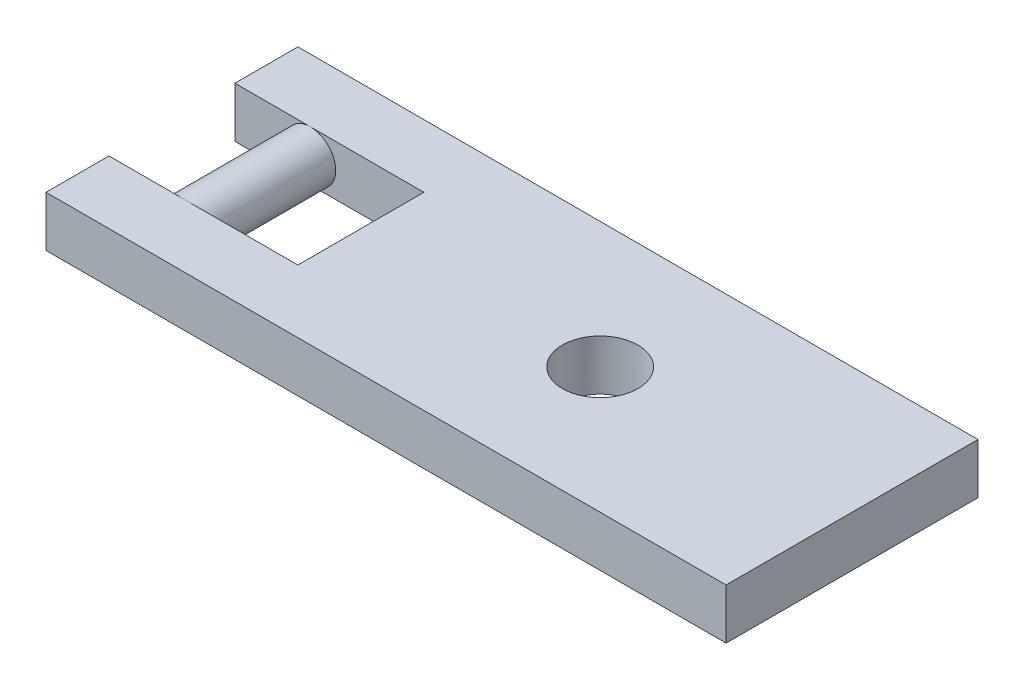
ISO-10303-21;
HEADER;
FILE_DESCRIPTION(('STEP AP214'),'2;1');
FILE_NAME('part.step','',(''),(''),'','','');
FILE_SCHEMA(('AUTOMOTIVE_DESIGN { 1 0 10303 214 1 1 1 1 }'));
ENDSEC;
DATA;
#1=APPLICATION_CONTEXT('core data for automotive mechanical design processes');
#2=APPLICATION_PROTOCOL_DEFINITION('international standard','automotive_design',2000,#1);
#3=PRODUCT_CONTEXT('',#1,'mechanical');
#4=PRODUCT('Part','Part','',(#3));
#5=PRODUCT_RELATED_PRODUCT_CATEGORY('part','',(#4));
#6=PRODUCT_DEFINITION_FORMATION('','',#4);
#7=PRODUCT_DEFINITION_CONTEXT('part definition',#1,'design');
#8=PRODUCT_DEFINITION('design','',#6,#7);
#9=PRODUCT_DEFINITION_SHAPE('','',#8);
#10=(LENGTH_UNIT() NAMED_UNIT(*) SI_UNIT(.MILLI.,.METRE.));
#11=(NAMED_UNIT(*) PLANE_ANGLE_UNIT() SI_UNIT($,.RADIAN.));
#12=(NAMED_UNIT(*) SI_UNIT($,.STERADIAN.) SOLID_ANGLE_UNIT());
#13=UNCERTAINTY_MEASURE_WITH_UNIT(LENGTH_MEASURE(1.E-05),#10,'distance_accuracy_value','');
#14=(GEOMETRIC_REPRESENTATION_CONTEXT(3) GLOBAL_UNCERTAINTY_ASSIGNED_CONTEXT((#13)) GLOBAL_UNIT_ASSIGNED_CONTEXT((#10,
#11,#12)) REPRESENTATION_CONTEXT('',''));
#15=CARTESIAN_POINT('',(0.,0.,0.));
#16=DIRECTION('',(0.,0.,1.));
#17=DIRECTION('',(1.,0.,0.));
#18=AXIS2_PLACEMENT_3D('',#15,#16,#17);
#19=CARTESIAN_POINT('',(-24.2987972115879,30.4038054968287,-2.5));
#20=DIRECTION('',(0.,0.,-1.));
#21=DIRECTION('',(-1.,0.,0.));
#22=AXIS2_PLACEMENT_3D('',#19,#20,#21);
#23=PLANE('',#22);
#24=CARTESIAN_POINT('',(-28.7987972115879,39.4038054968287,-2.5));
#25=DIRECTION('',(0.,0.,1.));
#26=DIRECTION('',(1.,0.,0.));
#27=AXIS2_PLACEMENT_3D('',#24,#25,#26);
#28=CIRCLE('',#27,1.);
#29=CARTESIAN_POINT('',(-28.7987972115879,38.4038054968287,-2.5));
#30=VERTEX_POINT('',#29);
#31=CARTESIAN_POINT('',(-28.7987972115879,40.4038054968287,-2.5));
#32=VERTEX_POINT('',#31);
#33=EDGE_CURVE('E144',#30,#32,#28,.T.);
#34=ORIENTED_EDGE('',*,*,#33,.F.);
#35=DIRECTION('',(1.,0.,0.));
#36=VECTOR('',#35,1.);
#37=CARTESIAN_POINT('',(-29.7987972115879,38.4038054968288,-2.5));
#38=LINE('',#37,#36);
#39=CARTESIAN_POINT('',(-24.2987972115879,38.4038054968288,-2.5));
#40=VERTEX_POINT('',#39);
#41=EDGE_CURVE('E197',#30,#40,#38,.T.);
#42=ORIENTED_EDGE('',*,*,#41,.T.);
#43=DIRECTION('',(0.,1.,0.));
#44=VECTOR('',#43,1.);
#45=CARTESIAN_POINT('',(-24.2987972115879,30.4038054968287,-2.5));
#46=LINE('',#45,#44);
#47=CARTESIAN_POINT('',(-24.2987972115879,40.4038054968287,-2.5));
#48=VERTEX_POINT('',#47);
#49=EDGE_CURVE('E156',#40,#48,#46,.T.);
#50=ORIENTED_EDGE('',*,*,#49,.T.);
#51=DIRECTION('',(-1.,0.,0.));
#52=VECTOR('',#51,1.);
#53=CARTESIAN_POINT('',(-24.2987972115879,40.4038054968287,-2.5));
#54=LINE('',#53,#52);
#55=EDGE_CURVE('E153',#48,#32,#54,.T.);
#56=ORIENTED_EDGE('',*,*,#55,.T.);
#57=EDGE_LOOP('',(#34,#42,#50,#56));
#58=FACE_BOUND('',#57,.T.);
#59=ADVANCED_FACE('F33',(#58),#23,.F.);
#60=CARTESIAN_POINT('',(-24.2987972115879,30.4038054968287,2.5));
#61=DIRECTION('',(0.,0.,1.));
#62=DIRECTION('',(1.,0.,0.));
#63=AXIS2_PLACEMENT_3D('',#60,#61,#62);
#64=PLANE('',#63);
#65=CARTESIAN_POINT('',(-28.7987972115879,39.4038054968287,2.5));
#66=DIRECTION('',(0.,0.,1.));
#67=DIRECTION('',(1.,0.,0.));
#68=AXIS2_PLACEMENT_3D('',#65,#66,#67);
#69=CIRCLE('',#68,1.);
#70=CARTESIAN_POINT('',(-28.7987972115879,40.4038054968287,2.5));
#71=VERTEX_POINT('',#70);
#72=CARTESIAN_POINT('',(-28.7987972115879,38.4038054968287,2.5));
#73=VERTEX_POINT('',#72);
#74=EDGE_CURVE('E129',#71,#73,#69,.T.);
#75=ORIENTED_EDGE('',*,*,#74,.T.);
#76=DIRECTION('',(-1.,0.,0.));
#77=VECTOR('',#76,1.);
#78=CARTESIAN_POINT('',(-29.7987972115879,38.4038054968288,2.5));
#79=LINE('',#78,#77);
#80=CARTESIAN_POINT('',(-31.7987972115879,38.4038054968288,2.5));
#81=VERTEX_POINT('',#80);
#82=EDGE_CURVE('E116',#73,#81,#79,.T.);
#83=ORIENTED_EDGE('',*,*,#82,.T.);
#84=DIRECTION('',(0.,-1.,0.));
#85=VECTOR('',#84,1.);
#86=CARTESIAN_POINT('',(-31.7987972115879,40.4038054968287,2.5));
#87=LINE('',#86,#85);
#88=CARTESIAN_POINT('',(-31.7987972115879,40.4038054968287,2.5));
#89=VERTEX_POINT('',#88);
#90=EDGE_CURVE('E158',#89,#81,#87,.T.);
#91=ORIENTED_EDGE('',*,*,#90,.F.);
#92=DIRECTION('',(1.,0.,0.));
#93=VECTOR('',#92,1.);
#94=CARTESIAN_POINT('',(-24.2987972115879,40.4038054968287,2.5));
#95=LINE('',#94,#93);
#96=EDGE_CURVE('E132',#89,#71,#95,.T.);
#97=ORIENTED_EDGE('',*,*,#96,.T.);
#98=EDGE_LOOP('',(#75,#83,#91,#97));
#99=FACE_BOUND('',#98,.T.);
#100=ADVANCED_FACE('F130',(#99),#64,.F.);
#101=CARTESIAN_POINT('',(-31.7987972115879,40.4038054968287,5.));
#102=DIRECTION('',(1.,0.,0.));
#103=DIRECTION('',(0.,0.,-1.));
#104=AXIS2_PLACEMENT_3D('',#101,#102,#103);
#105=PLANE('',#104);
#106=DIRECTION('',(0.,0.,-1.));
#107=VECTOR('',#106,1.);
#108=CARTESIAN_POINT('',(-31.7987972115879,38.4038054968288,5.));
#109=LINE('',#108,#107);
#110=CARTESIAN_POINT('',(-31.7987972115879,38.4038054968288,-2.5));
#111=VERTEX_POINT('',#110);
#112=CARTESIAN_POINT('',(-31.7987972115879,38.4038054968288,-5.));
#113=VERTEX_POINT('',#112);
#114=EDGE_CURVE('E193',#111,#113,#109,.T.);
#115=ORIENTED_EDGE('',*,*,#114,.F.);
#116=DIRECTION('',(0.,1.,0.));
#117=VECTOR('',#116,1.);
#118=CARTESIAN_POINT('',(-31.7987972115879,40.4038054968287,-2.5));
#119=LINE('',#118,#117);
#120=CARTESIAN_POINT('',(-31.7987972115879,40.4038054968287,-2.5));
#121=VERTEX_POINT('',#120);
#122=EDGE_CURVE('E161',#111,#121,#119,.T.);
#123=ORIENTED_EDGE('',*,*,#122,.T.);
#124=DIRECTION('',(0.,0.,-1.));
#125=VECTOR('',#124,1.);
#126=CARTESIAN_POINT('',(-31.7987972115879,40.4038054968287,5.));
#127=LINE('',#126,#125);
#128=CARTESIAN_POINT('',(-31.7987972115879,40.4038054968287,-5.));
#129=VERTEX_POINT('',#128);
#130=EDGE_CURVE('E191',#121,#129,#127,.T.);
#131=ORIENTED_EDGE('',*,*,#130,.T.);
#132=DIRECTION('',(0.,-1.,0.));
#133=VECTOR('',#132,1.);
#134=CARTESIAN_POINT('',(-31.7987972115879,40.4038054968287,-5.));
#135=LINE('',#134,#133);
#136=EDGE_CURVE('E182',#129,#113,#135,.T.);
#137=ORIENTED_EDGE('',*,*,#136,.T.);
#138=EDGE_LOOP('',(#115,#123,#131,#137));
#139=FACE_BOUND('',#138,.T.);
#140=ADVANCED_FACE('F210',(#139),#105,.F.);
#141=CARTESIAN_POINT('',(-4.79879721158793,40.4038054968287,5.));
#142=DIRECTION('',(1.,0.,0.));
#143=DIRECTION('',(0.,0.,-1.));
#144=AXIS2_PLACEMENT_3D('',#141,#142,#143);
#145=PLANE('',#144);
#146=DIRECTION('',(0.,-1.,0.));
#147=VECTOR('',#146,1.);
#148=CARTESIAN_POINT('',(-4.79879721158793,40.4038054968287,-5.));
#149=LINE('',#148,#147);
#150=CARTESIAN_POINT('',(-4.79879721158793,40.4038054968287,-5.));
#151=VERTEX_POINT('',#150);
#152=CARTESIAN_POINT('',(-4.79879721158793,38.4038054968287,-5.));
#153=VERTEX_POINT('',#152);
#154=EDGE_CURVE('E164',#151,#153,#149,.T.);
#155=ORIENTED_EDGE('',*,*,#154,.F.);
#156=DIRECTION('',(0.,0.,-1.));
#157=VECTOR('',#156,1.);
#158=CARTESIAN_POINT('',(-4.79879721158793,40.4038054968287,5.));
#159=LINE('',#158,#157);
#160=CARTESIAN_POINT('',(-4.79879721158793,40.4038054968287,5.));
#161=VERTEX_POINT('',#160);
#162=EDGE_CURVE('E126',#161,#151,#159,.T.);
#163=ORIENTED_EDGE('',*,*,#162,.F.);
#164=DIRECTION('',(0.,-1.,0.));
#165=VECTOR('',#164,1.);
#166=CARTESIAN_POINT('',(-4.79879721158793,40.4038054968287,5.));
#167=LINE('',#166,#165);
#168=CARTESIAN_POINT('',(-4.79879721158793,38.4038054968287,5.));
#169=VERTEX_POINT('',#168);
#170=EDGE_CURVE('E165',#161,#169,#167,.T.);
#171=ORIENTED_EDGE('',*,*,#170,.T.);
#172=DIRECTION('',(0.,0.,-1.));
#173=VECTOR('',#172,1.);
#174=CARTESIAN_POINT('',(-4.79879721158793,38.4038054968287,5.));
#175=LINE('',#174,#173);
#176=EDGE_CURVE('E176',#169,#153,#175,.T.);
#177=ORIENTED_EDGE('',*,*,#176,.T.);
#178=EDGE_LOOP('',(#155,#163,#171,#177));
#179=FACE_BOUND('',#178,.T.);
#180=ADVANCED_FACE('F35',(#179),#145,.T.);
#181=CARTESIAN_POINT('',(-4.79879721158793,40.4038054968287,5.));
#182=DIRECTION('',(0.,-1.,0.));
#183=DIRECTION('',(0.,0.,-1.));
#184=AXIS2_PLACEMENT_3D('',#181,#182,#183);
#185=PLANE('',#184);
#186=CARTESIAN_POINT('',(-14.7987972115879,40.4038054968287,0.));
#187=DIRECTION('',(0.,1.,0.));
#188=DIRECTION('',(0.,0.,1.));
#189=AXIS2_PLACEMENT_3D('',#186,#187,#188);
#190=CIRCLE('',#189,1.5);
#191=CARTESIAN_POINT('',(-14.7987972115879,40.4038054968287,1.5));
#192=VERTEX_POINT('',#191);
#193=EDGE_CURVE('E342',#192,#192,#190,.T.);
#194=ORIENTED_EDGE('',*,*,#193,.F.);
#195=EDGE_LOOP('',(#194));
#196=FACE_BOUND('',#195,.T.);
#197=ORIENTED_EDGE('',*,*,#130,.F.);
#198=EDGE_CURVE('E152',#32,#121,#54,.T.);
#199=ORIENTED_EDGE('',*,*,#198,.F.);
#200=ORIENTED_EDGE('',*,*,#55,.F.);
#201=DIRECTION('',(0.,0.,-1.));
#202=VECTOR('',#201,1.);
#203=CARTESIAN_POINT('',(-24.2987972115879,40.4038054968287,-2.5));
#204=LINE('',#203,#202);
#205=CARTESIAN_POINT('',(-24.2987972115879,40.4038054968287,2.5));
#206=VERTEX_POINT('',#205);
#207=EDGE_CURVE('E149',#206,#48,#204,.T.);
#208=ORIENTED_EDGE('',*,*,#207,.F.);
#209=EDGE_CURVE('E134',#71,#206,#95,.T.);
#210=ORIENTED_EDGE('',*,*,#209,.F.);
#211=ORIENTED_EDGE('',*,*,#96,.F.);
#212=CARTESIAN_POINT('',(-31.7987972115879,40.4038054968287,5.));
#213=VERTEX_POINT('',#212);
#214=EDGE_CURVE('E188',#213,#89,#127,.T.);
#215=ORIENTED_EDGE('',*,*,#214,.F.);
#216=DIRECTION('',(-1.,0.,0.));
#217=VECTOR('',#216,1.);
#218=CARTESIAN_POINT('',(-4.79879721158793,40.4038054968287,5.));
#219=LINE('',#218,#217);
#220=EDGE_CURVE('E174',#161,#213,#219,.T.);
#221=ORIENTED_EDGE('',*,*,#220,.F.);
#222=ORIENTED_EDGE('',*,*,#162,.T.);
#223=DIRECTION('',(-1.,0.,0.));
#224=VECTOR('',#223,1.);
#225=CARTESIAN_POINT('',(-4.79879721158793,40.4038054968287,-5.));
#226=LINE('',#225,#224);
#227=EDGE_CURVE('E169',#151,#129,#226,.T.);
#228=ORIENTED_EDGE('',*,*,#227,.T.);
#229=EDGE_LOOP('',(#197,#199,#200,#208,#210,#211,#215,#221,#222,#228));
#230=FACE_BOUND('',#229,.T.);
#231=ADVANCED_FACE('F206',(#196,#230),#185,.F.);
#232=ORIENTED_EDGE('',*,*,#214,.T.);
#233=ORIENTED_EDGE('',*,*,#90,.T.);
#234=CARTESIAN_POINT('',(-31.7987972115879,38.4038054968288,5.));
#235=VERTEX_POINT('',#234);
#236=EDGE_CURVE('E123',#235,#81,#109,.T.);
#237=ORIENTED_EDGE('',*,*,#236,.F.);
#238=DIRECTION('',(0.,-1.,0.));
#239=VECTOR('',#238,1.);
#240=CARTESIAN_POINT('',(-31.7987972115879,40.4038054968287,5.));
#241=LINE('',#240,#239);
#242=EDGE_CURVE('E171',#213,#235,#241,.T.);
#243=ORIENTED_EDGE('',*,*,#242,.F.);
#244=EDGE_LOOP('',(#232,#233,#237,#243));
#245=FACE_BOUND('',#244,.T.);
#246=ADVANCED_FACE('F225',(#245),#105,.F.);
#247=CARTESIAN_POINT('',(-29.7987972115879,38.4038054968288,5.));
#248=DIRECTION('',(0.,-1.,0.));
#249=DIRECTION('',(0.,0.,-1.));
#250=AXIS2_PLACEMENT_3D('',#247,#248,#249);
#251=PLANE('',#250);
#252=CARTESIAN_POINT('',(-14.7987972115879,38.4038054968288,0.));
#253=DIRECTION('',(0.,-1.,0.));
#254=DIRECTION('',(0.,0.,-1.));
#255=AXIS2_PLACEMENT_3D('',#252,#253,#254);
#256=CIRCLE('',#255,1.5);
#257=CARTESIAN_POINT('',(-14.7987972115879,38.4038054968288,-1.5));
#258=VERTEX_POINT('',#257);
#259=EDGE_CURVE('E37',#258,#258,#256,.T.);
#260=ORIENTED_EDGE('',*,*,#259,.F.);
#261=EDGE_LOOP('',(#260));
#262=FACE_BOUND('',#261,.T.);
#263=EDGE_CURVE('E42',#111,#30,#38,.T.);
#264=ORIENTED_EDGE('',*,*,#263,.F.);
#265=ORIENTED_EDGE('',*,*,#114,.T.);
#266=DIRECTION('',(-1.,0.,0.));
#267=VECTOR('',#266,1.);
#268=CARTESIAN_POINT('',(-29.7987972115879,38.4038054968288,-5.));
#269=LINE('',#268,#267);
#270=EDGE_CURVE('E179',#153,#113,#269,.T.);
#271=ORIENTED_EDGE('',*,*,#270,.F.);
#272=ORIENTED_EDGE('',*,*,#176,.F.);
#273=DIRECTION('',(-1.,0.,0.));
#274=VECTOR('',#273,1.);
#275=CARTESIAN_POINT('',(-4.79879721158793,38.4038054968287,5.));
#276=LINE('',#275,#274);
#277=EDGE_CURVE('E168',#169,#235,#276,.T.);
#278=ORIENTED_EDGE('',*,*,#277,.T.);
#279=ORIENTED_EDGE('',*,*,#236,.T.);
#280=ORIENTED_EDGE('',*,*,#82,.F.);
#281=CARTESIAN_POINT('',(-24.2987972115879,38.4038054968288,2.5));
#282=VERTEX_POINT('',#281);
#283=EDGE_CURVE('E107',#282,#73,#79,.T.);
#284=ORIENTED_EDGE('',*,*,#283,.F.);
#285=DIRECTION('',(0.,0.,1.));
#286=VECTOR('',#285,1.);
#287=CARTESIAN_POINT('',(-24.2987972115879,38.4038054968288,5.));
#288=LINE('',#287,#286);
#289=EDGE_CURVE('E115',#40,#282,#288,.T.);
#290=ORIENTED_EDGE('',*,*,#289,.F.);
#291=ORIENTED_EDGE('',*,*,#41,.F.);
#292=EDGE_LOOP('',(#264,#265,#271,#272,#278,#279,#280,#284,#290,#291));
#293=FACE_BOUND('',#292,.T.);
#294=ADVANCED_FACE('F121',(#262,#293),#251,.T.);
#295=CARTESIAN_POINT('',(0.,0.,5.));
#296=DIRECTION('',(0.,0.,-1.));
#297=DIRECTION('',(-1.,0.,0.));
#298=AXIS2_PLACEMENT_3D('',#295,#296,#297);
#299=PLANE('',#298);
#300=ORIENTED_EDGE('',*,*,#170,.F.);
#301=ORIENTED_EDGE('',*,*,#220,.T.);
#302=ORIENTED_EDGE('',*,*,#242,.T.);
#303=ORIENTED_EDGE('',*,*,#277,.F.);
#304=EDGE_LOOP('',(#300,#301,#302,#303));
#305=FACE_BOUND('',#304,.T.);
#306=ADVANCED_FACE('F223',(#305),#299,.F.);
#307=CARTESIAN_POINT('',(0.,0.,-5.));
#308=DIRECTION('',(0.,0.,-1.));
#309=DIRECTION('',(-1.,0.,0.));
#310=AXIS2_PLACEMENT_3D('',#307,#308,#309);
#311=PLANE('',#310);
#312=ORIENTED_EDGE('',*,*,#154,.T.);
#313=ORIENTED_EDGE('',*,*,#270,.T.);
#314=ORIENTED_EDGE('',*,*,#136,.F.);
#315=ORIENTED_EDGE('',*,*,#227,.F.);
#316=EDGE_LOOP('',(#312,#313,#314,#315));
#317=FACE_BOUND('',#316,.T.);
#318=ADVANCED_FACE('F218',(#317),#311,.T.);
#319=EDGE_CURVE('E49',#32,#30,#28,.T.);
#320=ORIENTED_EDGE('',*,*,#319,.F.);
#321=ORIENTED_EDGE('',*,*,#198,.T.);
#322=ORIENTED_EDGE('',*,*,#122,.F.);
#323=ORIENTED_EDGE('',*,*,#263,.T.);
#324=EDGE_LOOP('',(#320,#321,#322,#323));
#325=FACE_BOUND('',#324,.T.);
#326=ADVANCED_FACE('F207',(#325),#23,.F.);
#327=CARTESIAN_POINT('',(-28.7987972115879,39.4038054968287,2.5));
#328=DIRECTION('',(0.,0.,1.));
#329=DIRECTION('',(1.,0.,0.));
#330=AXIS2_PLACEMENT_3D('',#327,#328,#329);
#331=CIRCLE('',#330,1.);
#332=EDGE_CURVE('E11',#71,#73,#331,.F.);
#333=ORIENTED_EDGE('',*,*,#332,.F.);
#334=ORIENTED_EDGE('',*,*,#209,.T.);
#335=DIRECTION('',(0.,1.,0.));
#336=VECTOR('',#335,1.);
#337=CARTESIAN_POINT('',(-24.2987972115879,30.4038054968287,2.5));
#338=LINE('',#337,#336);
#339=EDGE_CURVE('E111',#282,#206,#338,.T.);
#340=ORIENTED_EDGE('',*,*,#339,.F.);
#341=ORIENTED_EDGE('',*,*,#283,.T.);
#342=EDGE_LOOP('',(#333,#334,#340,#341));
#343=FACE_BOUND('',#342,.T.);
#344=ADVANCED_FACE('F109',(#343),#64,.F.);
#345=CARTESIAN_POINT('',(-24.2987972115879,30.4038054968287,-2.5));
#346=DIRECTION('',(1.,0.,0.));
#347=DIRECTION('',(0.,0.,-1.));
#348=AXIS2_PLACEMENT_3D('',#345,#346,#347);
#349=PLANE('',#348);
#350=ORIENTED_EDGE('',*,*,#289,.T.);
#351=ORIENTED_EDGE('',*,*,#339,.T.);
#352=ORIENTED_EDGE('',*,*,#207,.T.);
#353=ORIENTED_EDGE('',*,*,#49,.F.);
#354=EDGE_LOOP('',(#350,#351,#352,#353));
#355=FACE_BOUND('',#354,.T.);
#356=ADVANCED_FACE('F140',(#355),#349,.F.);
#357=CARTESIAN_POINT('',(-28.7987972115879,39.4038054968287,2.5));
#358=DIRECTION('',(0.,0.,-1.));
#359=DIRECTION('',(-1.,0.,0.));
#360=AXIS2_PLACEMENT_3D('',#357,#358,#359);
#361=CYLINDRICAL_SURFACE('',#360,1.);
#362=ORIENTED_EDGE('',*,*,#74,.F.);
#363=ORIENTED_EDGE('',*,*,#332,.T.);
#364=EDGE_LOOP('',(#362,#363));
#365=FACE_BOUND('',#364,.T.);
#366=ORIENTED_EDGE('',*,*,#319,.T.);
#367=ORIENTED_EDGE('',*,*,#33,.T.);
#368=EDGE_LOOP('',(#366,#367));
#369=FACE_BOUND('',#368,.T.);
#370=ADVANCED_FACE('F136',(#365,#369),#361,.T.);
#371=CARTESIAN_POINT('',(-14.7987972115879,35.4038054968287,0.));
#372=DIRECTION('',(0.,1.,0.));
#373=DIRECTION('',(0.,0.,1.));
#374=AXIS2_PLACEMENT_3D('',#371,#372,#373);
#375=CYLINDRICAL_SURFACE('',#374,1.5);
#376=ORIENTED_EDGE('',*,*,#259,.T.);
#377=EDGE_LOOP('',(#376));
#378=FACE_BOUND('',#377,.T.);
#379=ORIENTED_EDGE('',*,*,#193,.T.);
#380=EDGE_LOOP('',(#379));
#381=FACE_BOUND('',#380,.T.);
#382=ADVANCED_FACE('F139',(#378,#381),#375,.F.);
#383=CLOSED_SHELL('',(#59,#100,#140,#180,#231,#246,#294,#306,#318,#326,#344,#356,#370,#382));
#384=MANIFOLD_SOLID_BREP('B2',#383);
#385=ADVANCED_BREP_SHAPE_REPRESENTATION('',(#18,#384),#14);
#386=SHAPE_DEFINITION_REPRESENTATION(#9,#385);
ENDSEC;
END-ISO-10303-21;
